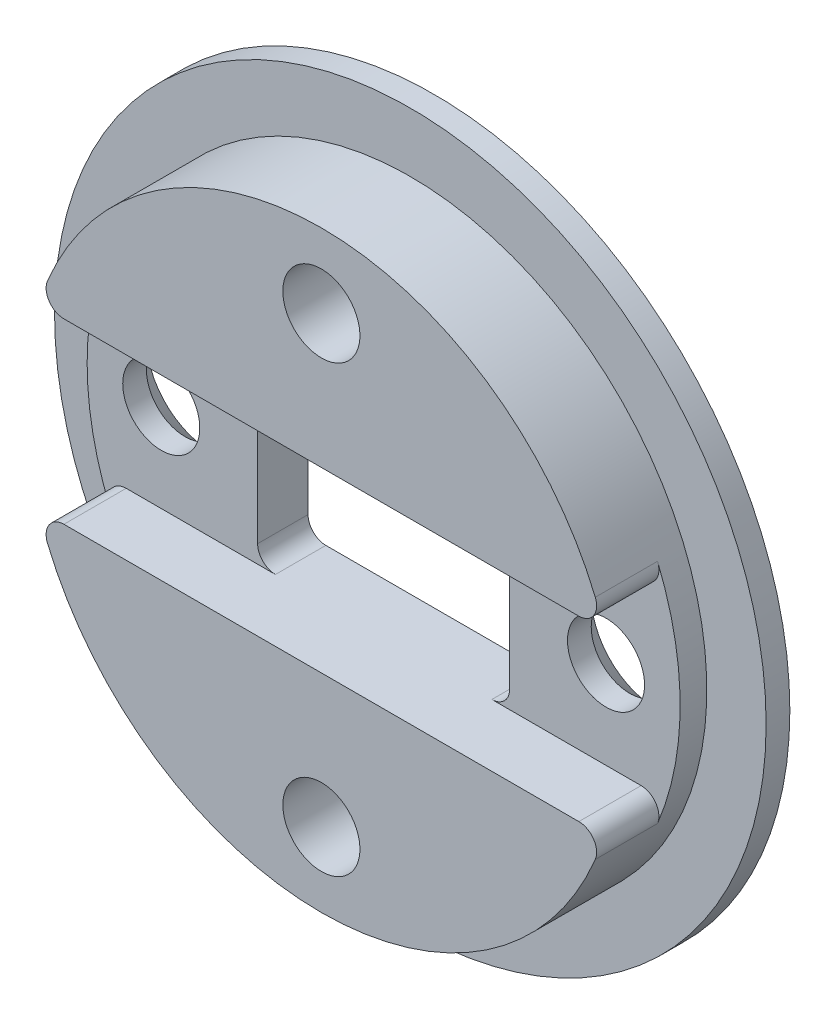
ISO-10303-21;
HEADER;
FILE_DESCRIPTION(('STEP AP214'),'2;1');
FILE_NAME('part.step','',(''),(''),'','','');
FILE_SCHEMA(('AUTOMOTIVE_DESIGN { 1 0 10303 214 1 1 1 1 }'));
ENDSEC;
DATA;
#1=APPLICATION_CONTEXT('core data for automotive mechanical design processes');
#2=APPLICATION_PROTOCOL_DEFINITION('international standard','automotive_design',2000,#1);
#3=PRODUCT_CONTEXT('',#1,'mechanical');
#4=PRODUCT('Part','Part','',(#3));
#5=PRODUCT_RELATED_PRODUCT_CATEGORY('part','',(#4));
#6=PRODUCT_DEFINITION_FORMATION('','',#4);
#7=PRODUCT_DEFINITION_CONTEXT('part definition',#1,'design');
#8=PRODUCT_DEFINITION('design','',#6,#7);
#9=PRODUCT_DEFINITION_SHAPE('','',#8);
#10=(LENGTH_UNIT() NAMED_UNIT(*) SI_UNIT(.MILLI.,.METRE.));
#11=(NAMED_UNIT(*) PLANE_ANGLE_UNIT() SI_UNIT($,.RADIAN.));
#12=(NAMED_UNIT(*) SI_UNIT($,.STERADIAN.) SOLID_ANGLE_UNIT());
#13=UNCERTAINTY_MEASURE_WITH_UNIT(LENGTH_MEASURE(1.E-05),#10,'distance_accuracy_value','');
#14=(GEOMETRIC_REPRESENTATION_CONTEXT(3) GLOBAL_UNCERTAINTY_ASSIGNED_CONTEXT((#13)) GLOBAL_UNIT_ASSIGNED_CONTEXT((#10,
#11,#12)) REPRESENTATION_CONTEXT('',''));
#15=CARTESIAN_POINT('',(0.,0.,0.));
#16=DIRECTION('',(0.,0.,1.));
#17=DIRECTION('',(1.,0.,0.));
#18=AXIS2_PLACEMENT_3D('',#15,#16,#17);
#19=CARTESIAN_POINT('',(0.,0.,0.));
#20=DIRECTION('',(0.,0.,-1.));
#21=DIRECTION('',(-1.,0.,0.));
#22=AXIS2_PLACEMENT_3D('',#19,#20,#21);
#23=PLANE('',#22);
#24=CARTESIAN_POINT('',(0.,-7.5,0.));
#25=DIRECTION('',(0.,0.,-1.));
#26=DIRECTION('',(-1.,0.,0.));
#27=AXIS2_PLACEMENT_3D('',#24,#25,#26);
#28=CIRCLE('',#27,1.3);
#29=CARTESIAN_POINT('',(-1.3,-7.5,0.));
#30=VERTEX_POINT('',#29);
#31=EDGE_CURVE('E620',#30,#30,#28,.T.);
#32=ORIENTED_EDGE('',*,*,#31,.T.);
#33=EDGE_LOOP('',(#32));
#34=FACE_BOUND('',#33,.T.);
#35=CARTESIAN_POINT('',(0.,0.,0.));
#36=DIRECTION('',(0.,0.,-1.));
#37=DIRECTION('',(-1.,0.,0.));
#38=AXIS2_PLACEMENT_3D('',#35,#36,#37);
#39=CIRCLE('',#38,10.);
#40=CARTESIAN_POINT('',(9.23757163663507,-3.82978723404255,0.));
#41=VERTEX_POINT('',#40);
#42=CARTESIAN_POINT('',(-9.23757163663507,-3.82978723404255,0.));
#43=VERTEX_POINT('',#42);
#44=EDGE_CURVE('E296',#41,#43,#39,.T.);
#45=ORIENTED_EDGE('',*,*,#44,.F.);
#46=CARTESIAN_POINT('',(8.68331733843697,-3.6,0.));
#47=DIRECTION('',(0.,0.,-1.));
#48=DIRECTION('',(-1.,0.,0.));
#49=AXIS2_PLACEMENT_3D('',#46,#47,#48);
#50=CIRCLE('',#49,0.6);
#51=CARTESIAN_POINT('',(8.68331733843697,-3.,0.));
#52=VERTEX_POINT('',#51);
#53=EDGE_CURVE('E236',#41,#52,#50,.F.);
#54=ORIENTED_EDGE('',*,*,#53,.T.);
#55=DIRECTION('',(1.,0.,0.));
#56=VECTOR('',#55,1.);
#57=CARTESIAN_POINT('',(-4.25,-3.,0.));
#58=LINE('',#57,#56);
#59=CARTESIAN_POINT('',(-8.68331733843697,-3.,0.));
#60=VERTEX_POINT('',#59);
#61=EDGE_CURVE('E281',#60,#52,#58,.T.);
#62=ORIENTED_EDGE('',*,*,#61,.F.);
#63=CARTESIAN_POINT('',(-8.68331733843697,-3.6,0.));
#64=DIRECTION('',(0.,0.,-1.));
#65=DIRECTION('',(-1.,0.,0.));
#66=AXIS2_PLACEMENT_3D('',#63,#64,#65);
#67=CIRCLE('',#66,0.6);
#68=EDGE_CURVE('E234',#60,#43,#67,.F.);
#69=ORIENTED_EDGE('',*,*,#68,.T.);
#70=EDGE_LOOP('',(#45,#54,#62,#69));
#71=FACE_BOUND('',#70,.T.);
#72=ADVANCED_FACE('F42',(#34,#71),#23,.F.);
#73=CARTESIAN_POINT('',(0.,7.5,0.));
#74=DIRECTION('',(0.,0.,-1.));
#75=DIRECTION('',(-1.,0.,0.));
#76=AXIS2_PLACEMENT_3D('',#73,#74,#75);
#77=CIRCLE('',#76,1.3);
#78=CARTESIAN_POINT('',(-1.3,7.5,0.));
#79=VERTEX_POINT('',#78);
#80=EDGE_CURVE('E630',#79,#79,#77,.T.);
#81=ORIENTED_EDGE('',*,*,#80,.T.);
#82=EDGE_LOOP('',(#81));
#83=FACE_BOUND('',#82,.T.);
#84=CARTESIAN_POINT('',(-9.23757163663507,3.82978723404255,0.));
#85=VERTEX_POINT('',#84);
#86=CARTESIAN_POINT('',(9.23757163663507,3.82978723404255,0.));
#87=VERTEX_POINT('',#86);
#88=EDGE_CURVE('E185',#85,#87,#39,.T.);
#89=ORIENTED_EDGE('',*,*,#88,.F.);
#90=CARTESIAN_POINT('',(-8.68331733843697,3.6,0.));
#91=DIRECTION('',(0.,0.,-1.));
#92=DIRECTION('',(-1.,0.,0.));
#93=AXIS2_PLACEMENT_3D('',#90,#91,#92);
#94=CIRCLE('',#93,0.6);
#95=CARTESIAN_POINT('',(-8.68331733843697,3.,0.));
#96=VERTEX_POINT('',#95);
#97=EDGE_CURVE('E228',#85,#96,#94,.F.);
#98=ORIENTED_EDGE('',*,*,#97,.T.);
#99=DIRECTION('',(-1.,0.,0.));
#100=VECTOR('',#99,1.);
#101=CARTESIAN_POINT('',(-4.25,3.,0.));
#102=LINE('',#101,#100);
#103=CARTESIAN_POINT('',(8.68331733843697,3.,0.));
#104=VERTEX_POINT('',#103);
#105=EDGE_CURVE('E285',#104,#96,#102,.T.);
#106=ORIENTED_EDGE('',*,*,#105,.F.);
#107=CARTESIAN_POINT('',(8.68331733843697,3.6,0.));
#108=DIRECTION('',(0.,0.,-1.));
#109=DIRECTION('',(-1.,0.,0.));
#110=AXIS2_PLACEMENT_3D('',#107,#108,#109);
#111=CIRCLE('',#110,0.6);
#112=EDGE_CURVE('E226',#104,#87,#111,.F.);
#113=ORIENTED_EDGE('',*,*,#112,.T.);
#114=EDGE_LOOP('',(#89,#98,#106,#113));
#115=FACE_BOUND('',#114,.T.);
#116=ADVANCED_FACE('F349',(#83,#115),#23,.F.);
#117=CARTESIAN_POINT('',(0.,0.,-3.8));
#118=DIRECTION('',(0.,0.,-1.));
#119=DIRECTION('',(-1.,0.,0.));
#120=AXIS2_PLACEMENT_3D('',#117,#118,#119);
#121=CYLINDRICAL_SURFACE('',#120,10.);
#122=CARTESIAN_POINT('',(0.,0.,-3.));
#123=DIRECTION('',(0.,0.,-1.));
#124=DIRECTION('',(-1.,0.,0.));
#125=AXIS2_PLACEMENT_3D('',#122,#123,#124);
#126=CIRCLE('',#125,10.);
#127=CARTESIAN_POINT('',(-10.,0.,-3.));
#128=VERTEX_POINT('',#127);
#129=EDGE_CURVE('E294',#128,#128,#126,.T.);
#130=ORIENTED_EDGE('',*,*,#129,.F.);
#131=EDGE_LOOP('',(#130));
#132=FACE_BOUND('',#131,.T.);
#133=CARTESIAN_POINT('',(0.,0.,-2.1));
#134=DIRECTION('',(0.,0.,-1.));
#135=DIRECTION('',(-1.,0.,0.));
#136=AXIS2_PLACEMENT_3D('',#133,#134,#135);
#137=CIRCLE('',#136,10.);
#138=CARTESIAN_POINT('',(-9.23757163663507,-3.82978723404255,-2.1));
#139=VERTEX_POINT('',#138);
#140=CARTESIAN_POINT('',(-9.23757163663507,3.82978723404255,-2.1));
#141=VERTEX_POINT('',#140);
#142=EDGE_CURVE('E274',#139,#141,#137,.T.);
#143=ORIENTED_EDGE('',*,*,#142,.T.);
#144=DIRECTION('',(0.,0.,-1.));
#145=VECTOR('',#144,1.);
#146=CARTESIAN_POINT('',(-9.23757163663507,3.82978723404255,-3.8));
#147=LINE('',#146,#145);
#148=EDGE_CURVE('E223',#141,#85,#147,.F.);
#149=ORIENTED_EDGE('',*,*,#148,.T.);
#150=ORIENTED_EDGE('',*,*,#88,.T.);
#151=DIRECTION('',(0.,0.,-1.));
#152=VECTOR('',#151,1.);
#153=CARTESIAN_POINT('',(9.23757163663507,3.82978723404255,-3.8));
#154=LINE('',#153,#152);
#155=CARTESIAN_POINT('',(9.23757163663507,3.82978723404255,-2.1));
#156=VERTEX_POINT('',#155);
#157=EDGE_CURVE('E217',#87,#156,#154,.T.);
#158=ORIENTED_EDGE('',*,*,#157,.T.);
#159=CARTESIAN_POINT('',(9.23757163663507,-3.82978723404255,-2.1));
#160=VERTEX_POINT('',#159);
#161=EDGE_CURVE('E276',#156,#160,#137,.T.);
#162=ORIENTED_EDGE('',*,*,#161,.T.);
#163=DIRECTION('',(0.,0.,-1.));
#164=VECTOR('',#163,1.);
#165=CARTESIAN_POINT('',(9.23757163663507,-3.82978723404255,-3.8));
#166=LINE('',#165,#164);
#167=EDGE_CURVE('E220',#160,#41,#166,.F.);
#168=ORIENTED_EDGE('',*,*,#167,.T.);
#169=ORIENTED_EDGE('',*,*,#44,.T.);
#170=DIRECTION('',(0.,0.,-1.));
#171=VECTOR('',#170,1.);
#172=CARTESIAN_POINT('',(-9.23757163663507,-3.82978723404255,-3.8));
#173=LINE('',#172,#171);
#174=EDGE_CURVE('E214',#43,#139,#173,.T.);
#175=ORIENTED_EDGE('',*,*,#174,.T.);
#176=EDGE_LOOP('',(#143,#149,#150,#158,#162,#168,#169,#175));
#177=FACE_BOUND('',#176,.T.);
#178=ADVANCED_FACE('F304',(#132,#177),#121,.T.);
#179=CARTESIAN_POINT('',(10.,0.,-3.));
#180=DIRECTION('',(0.,0.,-1.));
#181=DIRECTION('',(-1.,0.,0.));
#182=AXIS2_PLACEMENT_3D('',#179,#180,#181);
#183=PLANE('',#182);
#184=CARTESIAN_POINT('',(0.,0.,-3.));
#185=DIRECTION('',(0.,0.,-1.));
#186=DIRECTION('',(-1.,0.,0.));
#187=AXIS2_PLACEMENT_3D('',#184,#185,#186);
#188=CIRCLE('',#187,12.);
#189=CARTESIAN_POINT('',(-12.,0.,-3.));
#190=VERTEX_POINT('',#189);
#191=EDGE_CURVE('E291',#190,#190,#188,.T.);
#192=ORIENTED_EDGE('',*,*,#191,.F.);
#193=EDGE_LOOP('',(#192));
#194=FACE_BOUND('',#193,.T.);
#195=ORIENTED_EDGE('',*,*,#129,.T.);
#196=EDGE_LOOP('',(#195));
#197=FACE_BOUND('',#196,.T.);
#198=ADVANCED_FACE('F503',(#194,#197),#183,.F.);
#199=CARTESIAN_POINT('',(0.,0.,-3.8));
#200=DIRECTION('',(0.,0.,-1.));
#201=DIRECTION('',(-1.,0.,0.));
#202=AXIS2_PLACEMENT_3D('',#199,#200,#201);
#203=CYLINDRICAL_SURFACE('',#202,12.);
#204=CARTESIAN_POINT('',(0.,0.,-3.8));
#205=DIRECTION('',(0.,0.,-1.));
#206=DIRECTION('',(-1.,0.,0.));
#207=AXIS2_PLACEMENT_3D('',#204,#205,#206);
#208=CIRCLE('',#207,12.);
#209=CARTESIAN_POINT('',(-12.,0.,-3.8));
#210=VERTEX_POINT('',#209);
#211=EDGE_CURVE('E176',#210,#210,#208,.T.);
#212=ORIENTED_EDGE('',*,*,#211,.F.);
#213=EDGE_LOOP('',(#212));
#214=FACE_BOUND('',#213,.T.);
#215=ORIENTED_EDGE('',*,*,#191,.T.);
#216=EDGE_LOOP('',(#215));
#217=FACE_BOUND('',#216,.T.);
#218=ADVANCED_FACE('F500',(#214,#217),#203,.T.);
#219=CARTESIAN_POINT('',(12.,0.,-3.8));
#220=DIRECTION('',(0.,0.,1.));
#221=DIRECTION('',(1.,0.,0.));
#222=AXIS2_PLACEMENT_3D('',#219,#220,#221);
#223=PLANE('',#222);
#224=CARTESIAN_POINT('',(0.,7.5,-3.8));
#225=DIRECTION('',(0.,0.,-1.));
#226=DIRECTION('',(-1.,0.,0.));
#227=AXIS2_PLACEMENT_3D('',#224,#225,#226);
#228=CIRCLE('',#227,2.2);
#229=CARTESIAN_POINT('',(-2.2,7.5,-3.8));
#230=VERTEX_POINT('',#229);
#231=EDGE_CURVE('E636',#230,#230,#228,.T.);
#232=ORIENTED_EDGE('',*,*,#231,.F.);
#233=EDGE_LOOP('',(#232));
#234=FACE_BOUND('',#233,.T.);
#235=CARTESIAN_POINT('',(0.,-7.5,-3.8));
#236=DIRECTION('',(0.,0.,-1.));
#237=DIRECTION('',(-1.,0.,0.));
#238=AXIS2_PLACEMENT_3D('',#235,#236,#237);
#239=CIRCLE('',#238,2.2);
#240=CARTESIAN_POINT('',(-2.2,-7.5,-3.8));
#241=VERTEX_POINT('',#240);
#242=EDGE_CURVE('E627',#241,#241,#239,.T.);
#243=ORIENTED_EDGE('',*,*,#242,.F.);
#244=EDGE_LOOP('',(#243));
#245=FACE_BOUND('',#244,.T.);
#246=CARTESIAN_POINT('',(-7.5,0.,-3.8));
#247=DIRECTION('',(0.,0.,-1.));
#248=DIRECTION('',(-1.,0.,0.));
#249=AXIS2_PLACEMENT_3D('',#246,#247,#248);
#250=CIRCLE('',#249,2.2);
#251=CARTESIAN_POINT('',(-9.7,0.,-3.8));
#252=VERTEX_POINT('',#251);
#253=EDGE_CURVE('E617',#252,#252,#250,.T.);
#254=ORIENTED_EDGE('',*,*,#253,.F.);
#255=EDGE_LOOP('',(#254));
#256=FACE_BOUND('',#255,.T.);
#257=CARTESIAN_POINT('',(7.5,0.,-3.8));
#258=DIRECTION('',(0.,0.,-1.));
#259=DIRECTION('',(-1.,0.,0.));
#260=AXIS2_PLACEMENT_3D('',#257,#258,#259);
#261=CIRCLE('',#260,2.2);
#262=CARTESIAN_POINT('',(5.3,0.,-3.8));
#263=VERTEX_POINT('',#262);
#264=EDGE_CURVE('E256',#263,#263,#261,.T.);
#265=ORIENTED_EDGE('',*,*,#264,.F.);
#266=EDGE_LOOP('',(#265));
#267=FACE_BOUND('',#266,.T.);
#268=DIRECTION('',(0.,-1.,0.));
#269=VECTOR('',#268,1.);
#270=CARTESIAN_POINT('',(-4.25,-3.,-3.8));
#271=LINE('',#270,#269);
#272=CARTESIAN_POINT('',(-4.25,2.4,-3.8));
#273=VERTEX_POINT('',#272);
#274=CARTESIAN_POINT('',(-4.25,-2.4,-3.8));
#275=VERTEX_POINT('',#274);
#276=EDGE_CURVE('E164',#273,#275,#271,.T.);
#277=ORIENTED_EDGE('',*,*,#276,.T.);
#278=CARTESIAN_POINT('',(-3.65,-2.4,-3.8));
#279=DIRECTION('',(0.,0.,1.));
#280=DIRECTION('',(1.,0.,0.));
#281=AXIS2_PLACEMENT_3D('',#278,#279,#280);
#282=CIRCLE('',#281,0.6);
#283=CARTESIAN_POINT('',(-3.65,-3.,-3.8));
#284=VERTEX_POINT('',#283);
#285=EDGE_CURVE('E157',#275,#284,#282,.T.);
#286=ORIENTED_EDGE('',*,*,#285,.T.);
#287=DIRECTION('',(1.,0.,0.));
#288=VECTOR('',#287,1.);
#289=CARTESIAN_POINT('',(-4.25,-3.,-3.8));
#290=LINE('',#289,#288);
#291=CARTESIAN_POINT('',(3.65,-3.,-3.8));
#292=VERTEX_POINT('',#291);
#293=EDGE_CURVE('E161',#284,#292,#290,.T.);
#294=ORIENTED_EDGE('',*,*,#293,.T.);
#295=CARTESIAN_POINT('',(3.65,-2.4,-3.8));
#296=DIRECTION('',(0.,0.,1.));
#297=DIRECTION('',(1.,0.,0.));
#298=AXIS2_PLACEMENT_3D('',#295,#296,#297);
#299=CIRCLE('',#298,0.6);
#300=CARTESIAN_POINT('',(4.25,-2.4,-3.8));
#301=VERTEX_POINT('',#300);
#302=EDGE_CURVE('E207',#292,#301,#299,.T.);
#303=ORIENTED_EDGE('',*,*,#302,.T.);
#304=DIRECTION('',(0.,1.,0.));
#305=VECTOR('',#304,1.);
#306=CARTESIAN_POINT('',(4.25,-3.,-3.8));
#307=LINE('',#306,#305);
#308=CARTESIAN_POINT('',(4.25,2.4,-3.8));
#309=VERTEX_POINT('',#308);
#310=EDGE_CURVE('E277',#301,#309,#307,.T.);
#311=ORIENTED_EDGE('',*,*,#310,.T.);
#312=CARTESIAN_POINT('',(3.65,2.4,-3.8));
#313=DIRECTION('',(0.,0.,1.));
#314=DIRECTION('',(1.,0.,0.));
#315=AXIS2_PLACEMENT_3D('',#312,#313,#314);
#316=CIRCLE('',#315,0.6);
#317=CARTESIAN_POINT('',(3.65,3.,-3.8));
#318=VERTEX_POINT('',#317);
#319=EDGE_CURVE('E202',#309,#318,#316,.T.);
#320=ORIENTED_EDGE('',*,*,#319,.T.);
#321=DIRECTION('',(-1.,0.,0.));
#322=VECTOR('',#321,1.);
#323=CARTESIAN_POINT('',(-4.25,3.,-3.8));
#324=LINE('',#323,#322);
#325=CARTESIAN_POINT('',(-3.65,3.,-3.8));
#326=VERTEX_POINT('',#325);
#327=EDGE_CURVE('E280',#318,#326,#324,.T.);
#328=ORIENTED_EDGE('',*,*,#327,.T.);
#329=CARTESIAN_POINT('',(-3.65,2.4,-3.8));
#330=DIRECTION('',(0.,0.,1.));
#331=DIRECTION('',(1.,0.,0.));
#332=AXIS2_PLACEMENT_3D('',#329,#330,#331);
#333=CIRCLE('',#332,0.6);
#334=EDGE_CURVE('E212',#326,#273,#333,.T.);
#335=ORIENTED_EDGE('',*,*,#334,.T.);
#336=EDGE_LOOP('',(#277,#286,#294,#303,#311,#320,#328,#335));
#337=FACE_BOUND('',#336,.T.);
#338=ORIENTED_EDGE('',*,*,#211,.T.);
#339=EDGE_LOOP('',(#338));
#340=FACE_BOUND('',#339,.T.);
#341=ADVANCED_FACE('F159',(#234,#245,#256,#267,#337,#340),#223,.F.);
#342=CARTESIAN_POINT('',(4.25,-3.,-3.8));
#343=DIRECTION('',(1.,0.,0.));
#344=DIRECTION('',(0.,0.,-1.));
#345=AXIS2_PLACEMENT_3D('',#342,#343,#344);
#346=PLANE('',#345);
#347=DIRECTION('',(0.,1.,0.));
#348=VECTOR('',#347,1.);
#349=CARTESIAN_POINT('',(4.25,-3.,-2.1));
#350=LINE('',#349,#348);
#351=CARTESIAN_POINT('',(4.25,-2.4,-2.1));
#352=VERTEX_POINT('',#351);
#353=CARTESIAN_POINT('',(4.25,2.4,-2.1));
#354=VERTEX_POINT('',#353);
#355=EDGE_CURVE('E271',#352,#354,#350,.T.);
#356=ORIENTED_EDGE('',*,*,#355,.T.);
#357=DIRECTION('',(0.,0.,1.));
#358=VECTOR('',#357,1.);
#359=CARTESIAN_POINT('',(4.25,2.4,-3.8));
#360=LINE('',#359,#358);
#361=EDGE_CURVE('E198',#354,#309,#360,.F.);
#362=ORIENTED_EDGE('',*,*,#361,.T.);
#363=ORIENTED_EDGE('',*,*,#310,.F.);
#364=DIRECTION('',(0.,0.,1.));
#365=VECTOR('',#364,1.);
#366=CARTESIAN_POINT('',(4.25,-2.4,-2.1));
#367=LINE('',#366,#365);
#368=EDGE_CURVE('E195',#301,#352,#367,.T.);
#369=ORIENTED_EDGE('',*,*,#368,.T.);
#370=EDGE_LOOP('',(#356,#362,#363,#369));
#371=FACE_BOUND('',#370,.T.);
#372=ADVANCED_FACE('F324',(#371),#346,.F.);
#373=CARTESIAN_POINT('',(-4.25,-3.,-3.8));
#374=DIRECTION('',(0.,-1.,0.));
#375=DIRECTION('',(0.,0.,-1.));
#376=AXIS2_PLACEMENT_3D('',#373,#374,#375);
#377=PLANE('',#376);
#378=ORIENTED_EDGE('',*,*,#61,.T.);
#379=DIRECTION('',(0.,0.,-1.));
#380=VECTOR('',#379,1.);
#381=CARTESIAN_POINT('',(8.68331733843697,-3.,-3.8));
#382=LINE('',#381,#380);
#383=CARTESIAN_POINT('',(8.68331733843697,-3.,-2.1));
#384=VERTEX_POINT('',#383);
#385=EDGE_CURVE('E59',#52,#384,#382,.T.);
#386=ORIENTED_EDGE('',*,*,#385,.T.);
#387=DIRECTION('',(1.,0.,0.));
#388=VECTOR('',#387,1.);
#389=CARTESIAN_POINT('',(12.,-3.,-2.1));
#390=LINE('',#389,#388);
#391=CARTESIAN_POINT('',(3.65,-3.,-2.1));
#392=VERTEX_POINT('',#391);
#393=EDGE_CURVE('E249',#392,#384,#390,.T.);
#394=ORIENTED_EDGE('',*,*,#393,.F.);
#395=DIRECTION('',(0.,0.,1.));
#396=VECTOR('',#395,1.);
#397=CARTESIAN_POINT('',(3.65,-3.,-3.8));
#398=LINE('',#397,#396);
#399=EDGE_CURVE('E175',#392,#292,#398,.F.);
#400=ORIENTED_EDGE('',*,*,#399,.T.);
#401=ORIENTED_EDGE('',*,*,#293,.F.);
#402=DIRECTION('',(0.,0.,1.));
#403=VECTOR('',#402,1.);
#404=CARTESIAN_POINT('',(-3.65,-3.,-2.1));
#405=LINE('',#404,#403);
#406=CARTESIAN_POINT('',(-3.65,-3.,-2.1));
#407=VERTEX_POINT('',#406);
#408=EDGE_CURVE('E173',#284,#407,#405,.T.);
#409=ORIENTED_EDGE('',*,*,#408,.T.);
#410=CARTESIAN_POINT('',(-8.68331733843696,-3.,-2.1));
#411=VERTEX_POINT('',#410);
#412=EDGE_CURVE('E253',#411,#407,#390,.T.);
#413=ORIENTED_EDGE('',*,*,#412,.F.);
#414=DIRECTION('',(0.,0.,-1.));
#415=VECTOR('',#414,1.);
#416=CARTESIAN_POINT('',(-8.68331733843697,-3.,-3.8));
#417=LINE('',#416,#415);
#418=EDGE_CURVE('E238',#411,#60,#417,.F.);
#419=ORIENTED_EDGE('',*,*,#418,.T.);
#420=EDGE_LOOP('',(#378,#386,#394,#400,#401,#409,#413,#419));
#421=FACE_BOUND('',#420,.T.);
#422=ADVANCED_FACE('F172',(#421),#377,.F.);
#423=CARTESIAN_POINT('',(-4.25,-3.,-3.8));
#424=DIRECTION('',(-1.,0.,0.));
#425=DIRECTION('',(0.,0.,1.));
#426=AXIS2_PLACEMENT_3D('',#423,#424,#425);
#427=PLANE('',#426);
#428=DIRECTION('',(0.,-1.,0.));
#429=VECTOR('',#428,1.);
#430=CARTESIAN_POINT('',(-4.25,-3.,-2.1));
#431=LINE('',#430,#429);
#432=CARTESIAN_POINT('',(-4.25,2.4,-2.1));
#433=VERTEX_POINT('',#432);
#434=CARTESIAN_POINT('',(-4.25,-2.4,-2.1));
#435=VERTEX_POINT('',#434);
#436=EDGE_CURVE('E268',#433,#435,#431,.T.);
#437=ORIENTED_EDGE('',*,*,#436,.T.);
#438=DIRECTION('',(0.,0.,1.));
#439=VECTOR('',#438,1.);
#440=CARTESIAN_POINT('',(-4.25,-2.4,-3.8));
#441=LINE('',#440,#439);
#442=EDGE_CURVE('E183',#435,#275,#441,.F.);
#443=ORIENTED_EDGE('',*,*,#442,.T.);
#444=ORIENTED_EDGE('',*,*,#276,.F.);
#445=DIRECTION('',(0.,0.,1.));
#446=VECTOR('',#445,1.);
#447=CARTESIAN_POINT('',(-4.25,2.4,-2.1));
#448=LINE('',#447,#446);
#449=EDGE_CURVE('E180',#273,#433,#448,.T.);
#450=ORIENTED_EDGE('',*,*,#449,.T.);
#451=EDGE_LOOP('',(#437,#443,#444,#450));
#452=FACE_BOUND('',#451,.T.);
#453=ADVANCED_FACE('F340',(#452),#427,.F.);
#454=CARTESIAN_POINT('',(-4.25,3.,-3.8));
#455=DIRECTION('',(0.,1.,0.));
#456=DIRECTION('',(0.,0.,1.));
#457=AXIS2_PLACEMENT_3D('',#454,#455,#456);
#458=PLANE('',#457);
#459=ORIENTED_EDGE('',*,*,#105,.T.);
#460=DIRECTION('',(0.,0.,-1.));
#461=VECTOR('',#460,1.);
#462=CARTESIAN_POINT('',(-8.68331733843697,3.,-3.8));
#463=LINE('',#462,#461);
#464=CARTESIAN_POINT('',(-8.68331733843696,3.,-2.1));
#465=VERTEX_POINT('',#464);
#466=EDGE_CURVE('E232',#96,#465,#463,.T.);
#467=ORIENTED_EDGE('',*,*,#466,.T.);
#468=DIRECTION('',(-1.,0.,0.));
#469=VECTOR('',#468,1.);
#470=CARTESIAN_POINT('',(12.,3.,-2.1));
#471=LINE('',#470,#469);
#472=CARTESIAN_POINT('',(-3.65,3.,-2.1));
#473=VERTEX_POINT('',#472);
#474=EDGE_CURVE('E264',#473,#465,#471,.T.);
#475=ORIENTED_EDGE('',*,*,#474,.F.);
#476=DIRECTION('',(0.,0.,1.));
#477=VECTOR('',#476,1.);
#478=CARTESIAN_POINT('',(-3.65,3.,-3.8));
#479=LINE('',#478,#477);
#480=EDGE_CURVE('E190',#473,#326,#479,.F.);
#481=ORIENTED_EDGE('',*,*,#480,.T.);
#482=ORIENTED_EDGE('',*,*,#327,.F.);
#483=DIRECTION('',(0.,0.,1.));
#484=VECTOR('',#483,1.);
#485=CARTESIAN_POINT('',(3.65,3.,-2.1));
#486=LINE('',#485,#484);
#487=CARTESIAN_POINT('',(3.65,3.,-2.1));
#488=VERTEX_POINT('',#487);
#489=EDGE_CURVE('E192',#318,#488,#486,.T.);
#490=ORIENTED_EDGE('',*,*,#489,.T.);
#491=CARTESIAN_POINT('',(8.68331733843697,3.,-2.1));
#492=VERTEX_POINT('',#491);
#493=EDGE_CURVE('E267',#492,#488,#471,.T.);
#494=ORIENTED_EDGE('',*,*,#493,.F.);
#495=DIRECTION('',(0.,0.,-1.));
#496=VECTOR('',#495,1.);
#497=CARTESIAN_POINT('',(8.68331733843697,3.,-3.8));
#498=LINE('',#497,#496);
#499=EDGE_CURVE('E230',#492,#104,#498,.F.);
#500=ORIENTED_EDGE('',*,*,#499,.T.);
#501=EDGE_LOOP('',(#459,#467,#475,#481,#482,#490,#494,#500));
#502=FACE_BOUND('',#501,.T.);
#503=ADVANCED_FACE('F333',(#502),#458,.F.);
#504=CARTESIAN_POINT('',(10.,0.,-2.1));
#505=DIRECTION('',(0.,0.,-1.));
#506=DIRECTION('',(-1.,0.,0.));
#507=AXIS2_PLACEMENT_3D('',#504,#505,#506);
#508=PLANE('',#507);
#509=CARTESIAN_POINT('',(-7.5,0.,-2.1));
#510=DIRECTION('',(0.,0.,-1.));
#511=DIRECTION('',(-1.,0.,0.));
#512=AXIS2_PLACEMENT_3D('',#509,#510,#511);
#513=CIRCLE('',#512,1.3);
#514=CARTESIAN_POINT('',(-8.8,0.,-2.1));
#515=VERTEX_POINT('',#514);
#516=EDGE_CURVE('E46',#515,#515,#513,.T.);
#517=ORIENTED_EDGE('',*,*,#516,.T.);
#518=EDGE_LOOP('',(#517));
#519=FACE_BOUND('',#518,.T.);
#520=ORIENTED_EDGE('',*,*,#142,.F.);
#521=CARTESIAN_POINT('',(-8.68331733843697,-3.6,-2.1));
#522=DIRECTION('',(0.,0.,-1.));
#523=DIRECTION('',(-1.,0.,0.));
#524=AXIS2_PLACEMENT_3D('',#521,#522,#523);
#525=CIRCLE('',#524,0.6);
#526=EDGE_CURVE('E13',#139,#411,#525,.T.);
#527=ORIENTED_EDGE('',*,*,#526,.T.);
#528=ORIENTED_EDGE('',*,*,#412,.T.);
#529=CARTESIAN_POINT('',(-3.65,-2.4,-2.1));
#530=DIRECTION('',(0.,0.,-1.));
#531=DIRECTION('',(-1.,0.,0.));
#532=AXIS2_PLACEMENT_3D('',#529,#530,#531);
#533=CIRCLE('',#532,0.6);
#534=EDGE_CURVE('E169',#407,#435,#533,.T.);
#535=ORIENTED_EDGE('',*,*,#534,.T.);
#536=ORIENTED_EDGE('',*,*,#436,.F.);
#537=CARTESIAN_POINT('',(-3.65,2.4,-2.1));
#538=DIRECTION('',(0.,0.,-1.));
#539=DIRECTION('',(-1.,0.,0.));
#540=AXIS2_PLACEMENT_3D('',#537,#538,#539);
#541=CIRCLE('',#540,0.6);
#542=EDGE_CURVE('E209',#433,#473,#541,.T.);
#543=ORIENTED_EDGE('',*,*,#542,.T.);
#544=ORIENTED_EDGE('',*,*,#474,.T.);
#545=CARTESIAN_POINT('',(-8.68331733843697,3.6,-2.1));
#546=DIRECTION('',(0.,0.,-1.));
#547=DIRECTION('',(-1.,0.,0.));
#548=AXIS2_PLACEMENT_3D('',#545,#546,#547);
#549=CIRCLE('',#548,0.6);
#550=EDGE_CURVE('E241',#465,#141,#549,.T.);
#551=ORIENTED_EDGE('',*,*,#550,.T.);
#552=EDGE_LOOP('',(#520,#527,#528,#535,#536,#543,#544,#551));
#553=FACE_BOUND('',#552,.T.);
#554=ADVANCED_FACE('F342',(#519,#553),#508,.F.);
#555=CARTESIAN_POINT('',(7.5,0.,-2.1));
#556=DIRECTION('',(0.,0.,-1.));
#557=DIRECTION('',(-1.,0.,0.));
#558=AXIS2_PLACEMENT_3D('',#555,#556,#557);
#559=CIRCLE('',#558,1.3);
#560=CARTESIAN_POINT('',(6.2,0.,-2.1));
#561=VERTEX_POINT('',#560);
#562=EDGE_CURVE('E247',#561,#561,#559,.T.);
#563=ORIENTED_EDGE('',*,*,#562,.T.);
#564=EDGE_LOOP('',(#563));
#565=FACE_BOUND('',#564,.T.);
#566=ORIENTED_EDGE('',*,*,#161,.F.);
#567=CARTESIAN_POINT('',(8.68331733843697,3.6,-2.1));
#568=DIRECTION('',(0.,0.,-1.));
#569=DIRECTION('',(-1.,0.,0.));
#570=AXIS2_PLACEMENT_3D('',#567,#568,#569);
#571=CIRCLE('',#570,0.6);
#572=EDGE_CURVE('E51',#156,#492,#571,.T.);
#573=ORIENTED_EDGE('',*,*,#572,.T.);
#574=ORIENTED_EDGE('',*,*,#493,.T.);
#575=CARTESIAN_POINT('',(3.65,2.4,-2.1));
#576=DIRECTION('',(0.,0.,-1.));
#577=DIRECTION('',(-1.,0.,0.));
#578=AXIS2_PLACEMENT_3D('',#575,#576,#577);
#579=CIRCLE('',#578,0.6);
#580=EDGE_CURVE('E168',#488,#354,#579,.T.);
#581=ORIENTED_EDGE('',*,*,#580,.T.);
#582=ORIENTED_EDGE('',*,*,#355,.F.);
#583=CARTESIAN_POINT('',(3.65,-2.4,-2.1));
#584=DIRECTION('',(0.,0.,-1.));
#585=DIRECTION('',(-1.,0.,0.));
#586=AXIS2_PLACEMENT_3D('',#583,#584,#585);
#587=CIRCLE('',#586,0.6);
#588=EDGE_CURVE('E204',#352,#392,#587,.T.);
#589=ORIENTED_EDGE('',*,*,#588,.T.);
#590=ORIENTED_EDGE('',*,*,#393,.T.);
#591=CARTESIAN_POINT('',(8.68331733843697,-3.6,-2.1));
#592=DIRECTION('',(0.,0.,-1.));
#593=DIRECTION('',(-1.,0.,0.));
#594=AXIS2_PLACEMENT_3D('',#591,#592,#593);
#595=CIRCLE('',#594,0.6);
#596=EDGE_CURVE('E244',#384,#160,#595,.T.);
#597=ORIENTED_EDGE('',*,*,#596,.T.);
#598=EDGE_LOOP('',(#566,#573,#574,#581,#582,#589,#590,#597));
#599=FACE_BOUND('',#598,.T.);
#600=ADVANCED_FACE('F315',(#565,#599),#508,.F.);
#601=CARTESIAN_POINT('',(-3.65,-2.4,-3.8));
#602=DIRECTION('',(0.,0.,-1.));
#603=DIRECTION('',(-1.,0.,0.));
#604=AXIS2_PLACEMENT_3D('',#601,#602,#603);
#605=CYLINDRICAL_SURFACE('',#604,0.6);
#606=ORIENTED_EDGE('',*,*,#285,.F.);
#607=ORIENTED_EDGE('',*,*,#442,.F.);
#608=ORIENTED_EDGE('',*,*,#534,.F.);
#609=ORIENTED_EDGE('',*,*,#408,.F.);
#610=EDGE_LOOP('',(#606,#607,#608,#609));
#611=FACE_BOUND('',#610,.T.);
#612=ADVANCED_FACE('F179',(#611),#605,.F.);
#613=CARTESIAN_POINT('',(3.65,2.4,-3.8));
#614=DIRECTION('',(0.,0.,-1.));
#615=DIRECTION('',(-1.,0.,0.));
#616=AXIS2_PLACEMENT_3D('',#613,#614,#615);
#617=CYLINDRICAL_SURFACE('',#616,0.6);
#618=ORIENTED_EDGE('',*,*,#319,.F.);
#619=ORIENTED_EDGE('',*,*,#361,.F.);
#620=ORIENTED_EDGE('',*,*,#580,.F.);
#621=ORIENTED_EDGE('',*,*,#489,.F.);
#622=EDGE_LOOP('',(#618,#619,#620,#621));
#623=FACE_BOUND('',#622,.T.);
#624=ADVANCED_FACE('F328',(#623),#617,.F.);
#625=CARTESIAN_POINT('',(3.65,-2.4,-3.8));
#626=DIRECTION('',(0.,0.,-1.));
#627=DIRECTION('',(-1.,0.,0.));
#628=AXIS2_PLACEMENT_3D('',#625,#626,#627);
#629=CYLINDRICAL_SURFACE('',#628,0.6);
#630=ORIENTED_EDGE('',*,*,#302,.F.);
#631=ORIENTED_EDGE('',*,*,#399,.F.);
#632=ORIENTED_EDGE('',*,*,#588,.F.);
#633=ORIENTED_EDGE('',*,*,#368,.F.);
#634=EDGE_LOOP('',(#630,#631,#632,#633));
#635=FACE_BOUND('',#634,.T.);
#636=ADVANCED_FACE('F320',(#635),#629,.F.);
#637=CARTESIAN_POINT('',(-3.65,2.4,-3.8));
#638=DIRECTION('',(0.,0.,-1.));
#639=DIRECTION('',(-1.,0.,0.));
#640=AXIS2_PLACEMENT_3D('',#637,#638,#639);
#641=CYLINDRICAL_SURFACE('',#640,0.6);
#642=ORIENTED_EDGE('',*,*,#334,.F.);
#643=ORIENTED_EDGE('',*,*,#480,.F.);
#644=ORIENTED_EDGE('',*,*,#542,.F.);
#645=ORIENTED_EDGE('',*,*,#449,.F.);
#646=EDGE_LOOP('',(#642,#643,#644,#645));
#647=FACE_BOUND('',#646,.T.);
#648=ADVANCED_FACE('F337',(#647),#641,.F.);
#649=CARTESIAN_POINT('',(-8.68331733843697,3.6,-3.8));
#650=DIRECTION('',(0.,0.,-1.));
#651=DIRECTION('',(-1.,0.,0.));
#652=AXIS2_PLACEMENT_3D('',#649,#650,#651);
#653=CYLINDRICAL_SURFACE('',#652,0.6);
#654=ORIENTED_EDGE('',*,*,#550,.F.);
#655=ORIENTED_EDGE('',*,*,#466,.F.);
#656=ORIENTED_EDGE('',*,*,#97,.F.);
#657=ORIENTED_EDGE('',*,*,#148,.F.);
#658=EDGE_LOOP('',(#654,#655,#656,#657));
#659=FACE_BOUND('',#658,.T.);
#660=ADVANCED_FACE('F347',(#659),#653,.T.);
#661=CARTESIAN_POINT('',(8.68331733843697,-3.6,-3.8));
#662=DIRECTION('',(0.,0.,-1.));
#663=DIRECTION('',(-1.,0.,0.));
#664=AXIS2_PLACEMENT_3D('',#661,#662,#663);
#665=CYLINDRICAL_SURFACE('',#664,0.6);
#666=ORIENTED_EDGE('',*,*,#596,.F.);
#667=ORIENTED_EDGE('',*,*,#385,.F.);
#668=ORIENTED_EDGE('',*,*,#53,.F.);
#669=ORIENTED_EDGE('',*,*,#167,.F.);
#670=EDGE_LOOP('',(#666,#667,#668,#669));
#671=FACE_BOUND('',#670,.T.);
#672=ADVANCED_FACE('F313',(#671),#665,.T.);
#673=CARTESIAN_POINT('',(8.68331733843697,3.6,-3.8));
#674=DIRECTION('',(0.,0.,-1.));
#675=DIRECTION('',(-1.,0.,0.));
#676=AXIS2_PLACEMENT_3D('',#673,#674,#675);
#677=CYLINDRICAL_SURFACE('',#676,0.6);
#678=ORIENTED_EDGE('',*,*,#112,.F.);
#679=ORIENTED_EDGE('',*,*,#499,.F.);
#680=ORIENTED_EDGE('',*,*,#572,.F.);
#681=ORIENTED_EDGE('',*,*,#157,.F.);
#682=EDGE_LOOP('',(#678,#679,#680,#681));
#683=FACE_BOUND('',#682,.T.);
#684=ADVANCED_FACE('F354',(#683),#677,.T.);
#685=CARTESIAN_POINT('',(-8.68331733843697,-3.6,-3.8));
#686=DIRECTION('',(0.,0.,-1.));
#687=DIRECTION('',(-1.,0.,0.));
#688=AXIS2_PLACEMENT_3D('',#685,#686,#687);
#689=CYLINDRICAL_SURFACE('',#688,0.6);
#690=ORIENTED_EDGE('',*,*,#68,.F.);
#691=ORIENTED_EDGE('',*,*,#418,.F.);
#692=ORIENTED_EDGE('',*,*,#526,.F.);
#693=ORIENTED_EDGE('',*,*,#174,.F.);
#694=EDGE_LOOP('',(#690,#691,#692,#693));
#695=FACE_BOUND('',#694,.T.);
#696=ADVANCED_FACE('F44',(#695),#689,.T.);
#697=CARTESIAN_POINT('',(7.5,0.,-3.8));
#698=DIRECTION('',(0.,0.,-1.));
#699=DIRECTION('',(-1.,0.,0.));
#700=AXIS2_PLACEMENT_3D('',#697,#698,#699);
#701=CYLINDRICAL_SURFACE('',#700,1.3);
#702=CARTESIAN_POINT('',(7.5,0.,-2.9));
#703=DIRECTION('',(0.,0.,-1.));
#704=DIRECTION('',(-1.,0.,0.));
#705=AXIS2_PLACEMENT_3D('',#702,#703,#704);
#706=CIRCLE('',#705,1.3);
#707=CARTESIAN_POINT('',(6.2,0.,-2.9));
#708=VERTEX_POINT('',#707);
#709=EDGE_CURVE('E250',#708,#708,#706,.T.);
#710=ORIENTED_EDGE('',*,*,#709,.T.);
#711=EDGE_LOOP('',(#710));
#712=FACE_BOUND('',#711,.T.);
#713=ORIENTED_EDGE('',*,*,#562,.F.);
#714=EDGE_LOOP('',(#713));
#715=FACE_BOUND('',#714,.T.);
#716=ADVANCED_FACE('F360',(#712,#715),#701,.F.);
#717=CARTESIAN_POINT('',(7.5,0.,-3.8));
#718=DIRECTION('',(0.,0.,-1.));
#719=DIRECTION('',(-1.,0.,0.));
#720=AXIS2_PLACEMENT_3D('',#717,#718,#719);
#721=CONICAL_SURFACE('',#720,2.2,0.785398163397449);
#722=ORIENTED_EDGE('',*,*,#709,.F.);
#723=EDGE_LOOP('',(#722));
#724=FACE_BOUND('',#723,.T.);
#725=ORIENTED_EDGE('',*,*,#264,.T.);
#726=EDGE_LOOP('',(#725));
#727=FACE_BOUND('',#726,.T.);
#728=ADVANCED_FACE('F416',(#724,#727),#721,.F.);
#729=CARTESIAN_POINT('',(-7.5,0.,-3.8));
#730=DIRECTION('',(0.,0.,-1.));
#731=DIRECTION('',(-1.,0.,0.));
#732=AXIS2_PLACEMENT_3D('',#729,#730,#731);
#733=CYLINDRICAL_SURFACE('',#732,1.3);
#734=CARTESIAN_POINT('',(-7.5,0.,-2.9));
#735=DIRECTION('',(0.,0.,-1.));
#736=DIRECTION('',(-1.,0.,0.));
#737=AXIS2_PLACEMENT_3D('',#734,#735,#736);
#738=CIRCLE('',#737,1.3);
#739=CARTESIAN_POINT('',(-8.8,0.,-2.9));
#740=VERTEX_POINT('',#739);
#741=EDGE_CURVE('E615',#740,#740,#738,.T.);
#742=ORIENTED_EDGE('',*,*,#741,.T.);
#743=EDGE_LOOP('',(#742));
#744=FACE_BOUND('',#743,.T.);
#745=ORIENTED_EDGE('',*,*,#516,.F.);
#746=EDGE_LOOP('',(#745));
#747=FACE_BOUND('',#746,.T.);
#748=ADVANCED_FACE('F426',(#744,#747),#733,.F.);
#749=CARTESIAN_POINT('',(-7.5,0.,-3.8));
#750=DIRECTION('',(0.,0.,-1.));
#751=DIRECTION('',(-1.,0.,0.));
#752=AXIS2_PLACEMENT_3D('',#749,#750,#751);
#753=CONICAL_SURFACE('',#752,2.2,0.785398163397449);
#754=ORIENTED_EDGE('',*,*,#741,.F.);
#755=EDGE_LOOP('',(#754));
#756=FACE_BOUND('',#755,.T.);
#757=ORIENTED_EDGE('',*,*,#253,.T.);
#758=EDGE_LOOP('',(#757));
#759=FACE_BOUND('',#758,.T.);
#760=ADVANCED_FACE('F436',(#756,#759),#753,.F.);
#761=CARTESIAN_POINT('',(0.,-7.5,-3.8));
#762=DIRECTION('',(0.,0.,-1.));
#763=DIRECTION('',(-1.,0.,0.));
#764=AXIS2_PLACEMENT_3D('',#761,#762,#763);
#765=CYLINDRICAL_SURFACE('',#764,1.29999999999999);
#766=ORIENTED_EDGE('',*,*,#31,.F.);
#767=EDGE_LOOP('',(#766));
#768=FACE_BOUND('',#767,.T.);
#769=CARTESIAN_POINT('',(0.,-7.5,-2.9));
#770=DIRECTION('',(0.,0.,-1.));
#771=DIRECTION('',(-1.,0.,0.));
#772=AXIS2_PLACEMENT_3D('',#769,#770,#771);
#773=CIRCLE('',#772,1.29999999999999);
#774=CARTESIAN_POINT('',(-1.29999999999999,-7.5,-2.9));
#775=VERTEX_POINT('',#774);
#776=EDGE_CURVE('E624',#775,#775,#773,.T.);
#777=ORIENTED_EDGE('',*,*,#776,.T.);
#778=EDGE_LOOP('',(#777));
#779=FACE_BOUND('',#778,.T.);
#780=ADVANCED_FACE('F445',(#768,#779),#765,.F.);
#781=CARTESIAN_POINT('',(0.,-7.5,-3.8));
#782=DIRECTION('',(0.,0.,-1.));
#783=DIRECTION('',(-1.,0.,0.));
#784=AXIS2_PLACEMENT_3D('',#781,#782,#783);
#785=CONICAL_SURFACE('',#784,2.2,0.785398163397455);
#786=ORIENTED_EDGE('',*,*,#776,.F.);
#787=EDGE_LOOP('',(#786));
#788=FACE_BOUND('',#787,.T.);
#789=ORIENTED_EDGE('',*,*,#242,.T.);
#790=EDGE_LOOP('',(#789));
#791=FACE_BOUND('',#790,.T.);
#792=ADVANCED_FACE('F455',(#788,#791),#785,.F.);
#793=CARTESIAN_POINT('',(0.,7.5,-3.8));
#794=DIRECTION('',(0.,0.,-1.));
#795=DIRECTION('',(-1.,0.,0.));
#796=AXIS2_PLACEMENT_3D('',#793,#794,#795);
#797=CYLINDRICAL_SURFACE('',#796,1.29999999999999);
#798=ORIENTED_EDGE('',*,*,#80,.F.);
#799=EDGE_LOOP('',(#798));
#800=FACE_BOUND('',#799,.T.);
#801=CARTESIAN_POINT('',(0.,7.5,-2.9));
#802=DIRECTION('',(0.,0.,-1.));
#803=DIRECTION('',(-1.,0.,0.));
#804=AXIS2_PLACEMENT_3D('',#801,#802,#803);
#805=CIRCLE('',#804,1.29999999999999);
#806=CARTESIAN_POINT('',(-1.29999999999999,7.5,-2.9));
#807=VERTEX_POINT('',#806);
#808=EDGE_CURVE('E633',#807,#807,#805,.T.);
#809=ORIENTED_EDGE('',*,*,#808,.T.);
#810=EDGE_LOOP('',(#809));
#811=FACE_BOUND('',#810,.T.);
#812=ADVANCED_FACE('F466',(#800,#811),#797,.F.);
#813=CARTESIAN_POINT('',(0.,7.5,-3.8));
#814=DIRECTION('',(0.,0.,-1.));
#815=DIRECTION('',(-1.,0.,0.));
#816=AXIS2_PLACEMENT_3D('',#813,#814,#815);
#817=CONICAL_SURFACE('',#816,2.2,0.785398163397455);
#818=ORIENTED_EDGE('',*,*,#808,.F.);
#819=EDGE_LOOP('',(#818));
#820=FACE_BOUND('',#819,.T.);
#821=ORIENTED_EDGE('',*,*,#231,.T.);
#822=EDGE_LOOP('',(#821));
#823=FACE_BOUND('',#822,.T.);
#824=ADVANCED_FACE('F476',(#820,#823),#817,.F.);
#825=CLOSED_SHELL('',(#72,#116,#178,#198,#218,#341,#372,#422,#453,#503,#554,#600,#612,#624,#636,
#648,#660,#672,#684,#696,#716,#728,#748,#760,#780,#792,#812,#824));
#826=MANIFOLD_SOLID_BREP('B2',#825);
#827=ADVANCED_BREP_SHAPE_REPRESENTATION('',(#18,#826),#14);
#828=SHAPE_DEFINITION_REPRESENTATION(#9,#827);
ENDSEC;
END-ISO-10303-21;
